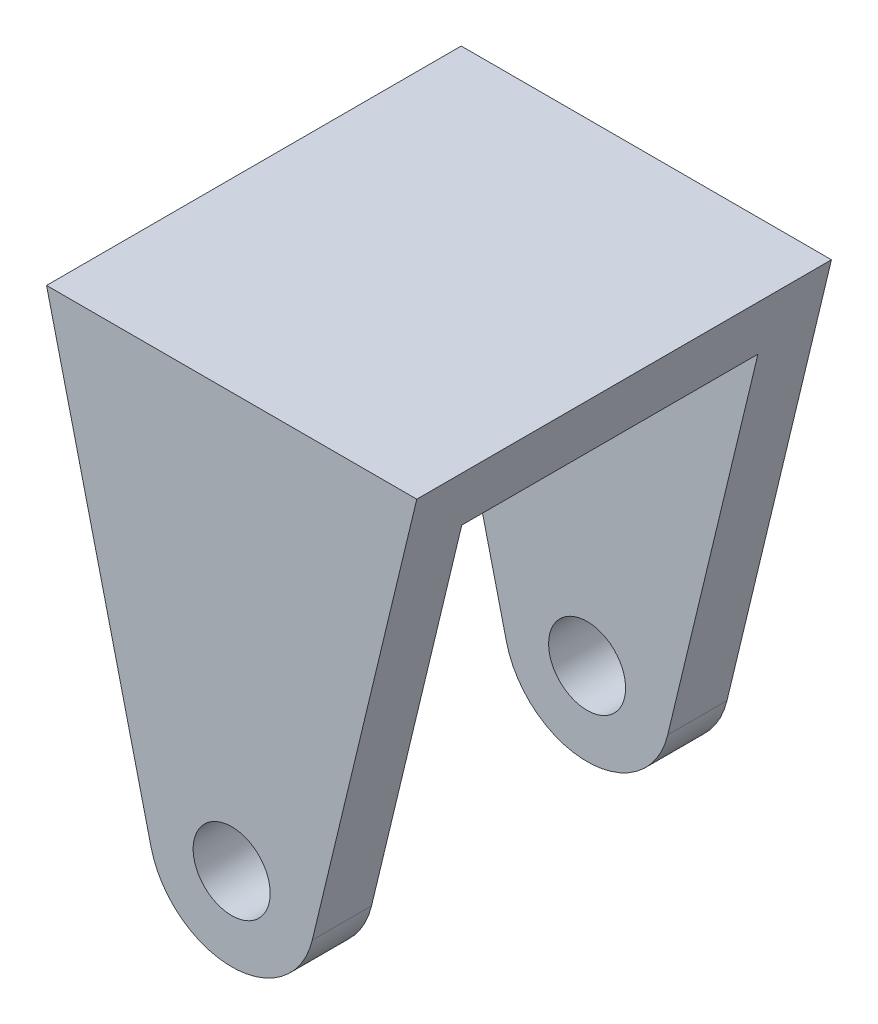
ISO-10303-21;
HEADER;
FILE_DESCRIPTION(('STEP AP214'),'2;1');
FILE_NAME('part.step','',(''),(''),'','','');
FILE_SCHEMA(('AUTOMOTIVE_DESIGN { 1 0 10303 214 1 1 1 1 }'));
ENDSEC;
DATA;
#1=APPLICATION_CONTEXT('core data for automotive mechanical design processes');
#2=APPLICATION_PROTOCOL_DEFINITION('international standard','automotive_design',2000,#1);
#3=PRODUCT_CONTEXT('',#1,'mechanical');
#4=PRODUCT('Part','Part','',(#3));
#5=PRODUCT_RELATED_PRODUCT_CATEGORY('part','',(#4));
#6=PRODUCT_DEFINITION_FORMATION('','',#4);
#7=PRODUCT_DEFINITION_CONTEXT('part definition',#1,'design');
#8=PRODUCT_DEFINITION('design','',#6,#7);
#9=PRODUCT_DEFINITION_SHAPE('','',#8);
#10=(LENGTH_UNIT() NAMED_UNIT(*) SI_UNIT(.MILLI.,.METRE.));
#11=(NAMED_UNIT(*) PLANE_ANGLE_UNIT() SI_UNIT($,.RADIAN.));
#12=(NAMED_UNIT(*) SI_UNIT($,.STERADIAN.) SOLID_ANGLE_UNIT());
#13=UNCERTAINTY_MEASURE_WITH_UNIT(LENGTH_MEASURE(1.E-05),#10,'distance_accuracy_value','');
#14=(GEOMETRIC_REPRESENTATION_CONTEXT(3) GLOBAL_UNCERTAINTY_ASSIGNED_CONTEXT((#13)) GLOBAL_UNIT_ASSIGNED_CONTEXT((#10,
#11,#12)) REPRESENTATION_CONTEXT('',''));
#15=CARTESIAN_POINT('',(0.,0.,0.));
#16=DIRECTION('',(0.,0.,1.));
#17=DIRECTION('',(1.,0.,0.));
#18=AXIS2_PLACEMENT_3D('',#15,#16,#17);
#19=CARTESIAN_POINT('',(0.,0.,140.));
#20=DIRECTION('',(0.,0.,-1.));
#21=DIRECTION('',(-1.,0.,0.));
#22=AXIS2_PLACEMENT_3D('',#19,#20,#21);
#23=CYLINDRICAL_SURFACE('',#22,56.);
#24=DIRECTION('',(0.,0.,-1.));
#25=VECTOR('',#24,1.);
#26=CARTESIAN_POINT('',(54.4448332198552,-13.1057291160068,140.));
#27=LINE('',#26,#25);
#28=CARTESIAN_POINT('',(54.4448332198552,-13.1057291160068,-100.));
#29=VERTEX_POINT('',#28);
#30=CARTESIAN_POINT('',(54.4448332198552,-13.1057291160068,-140.));
#31=VERTEX_POINT('',#30);
#32=EDGE_CURVE('E193',#29,#31,#27,.T.);
#33=ORIENTED_EDGE('',*,*,#32,.F.);
#34=CARTESIAN_POINT('',(0.,0.,-100.));
#35=DIRECTION('',(0.,0.,-1.));
#36=DIRECTION('',(-1.,0.,0.));
#37=AXIS2_PLACEMENT_3D('',#34,#35,#36);
#38=CIRCLE('',#37,56.);
#39=CARTESIAN_POINT('',(-54.4448332198552,-13.1057291160068,-100.));
#40=VERTEX_POINT('',#39);
#41=EDGE_CURVE('E57',#29,#40,#38,.T.);
#42=ORIENTED_EDGE('',*,*,#41,.T.);
#43=DIRECTION('',(0.,0.,-1.));
#44=VECTOR('',#43,1.);
#45=CARTESIAN_POINT('',(-54.4448332198552,-13.1057291160068,140.));
#46=LINE('',#45,#44);
#47=CARTESIAN_POINT('',(-54.4448332198552,-13.1057291160068,-140.));
#48=VERTEX_POINT('',#47);
#49=EDGE_CURVE('E135',#40,#48,#46,.T.);
#50=ORIENTED_EDGE('',*,*,#49,.T.);
#51=CARTESIAN_POINT('',(0.,0.,-140.));
#52=DIRECTION('',(0.,0.,1.));
#53=DIRECTION('',(1.,0.,0.));
#54=AXIS2_PLACEMENT_3D('',#51,#52,#53);
#55=CIRCLE('',#54,56.);
#56=EDGE_CURVE('E173',#48,#31,#55,.T.);
#57=ORIENTED_EDGE('',*,*,#56,.T.);
#58=EDGE_LOOP('',(#33,#42,#50,#57));
#59=FACE_BOUND('',#58,.T.);
#60=ADVANCED_FACE('F41',(#59),#23,.T.);
#61=CARTESIAN_POINT('',(0.,0.,140.));
#62=DIRECTION('',(0.,0.,-1.));
#63=DIRECTION('',(-1.,0.,0.));
#64=AXIS2_PLACEMENT_3D('',#61,#62,#63);
#65=CYLINDRICAL_SURFACE('',#64,26.);
#66=CARTESIAN_POINT('',(0.,0.,100.));
#67=DIRECTION('',(0.,0.,1.));
#68=DIRECTION('',(1.,0.,0.));
#69=AXIS2_PLACEMENT_3D('',#66,#67,#68);
#70=CIRCLE('',#69,26.);
#71=CARTESIAN_POINT('',(26.,0.,100.));
#72=VERTEX_POINT('',#71);
#73=EDGE_CURVE('E137',#72,#72,#70,.T.);
#74=ORIENTED_EDGE('',*,*,#73,.F.);
#75=EDGE_LOOP('',(#74));
#76=FACE_BOUND('',#75,.T.);
#77=CARTESIAN_POINT('',(0.,0.,140.));
#78=DIRECTION('',(0.,0.,1.));
#79=DIRECTION('',(1.,0.,0.));
#80=AXIS2_PLACEMENT_3D('',#77,#78,#79);
#81=CIRCLE('',#80,26.);
#82=CARTESIAN_POINT('',(26.,0.,140.));
#83=VERTEX_POINT('',#82);
#84=EDGE_CURVE('E167',#83,#83,#81,.T.);
#85=ORIENTED_EDGE('',*,*,#84,.T.);
#86=EDGE_LOOP('',(#85));
#87=FACE_BOUND('',#86,.T.);
#88=ADVANCED_FACE('F231',(#76,#87),#65,.F.);
#89=CARTESIAN_POINT('',(-54.4448332198552,-13.1057291160068,140.));
#90=DIRECTION('',(0.972229164640272,0.23403087707155,0.));
#91=DIRECTION('',(-0.23403087707155,0.972229164640272,0.));
#92=AXIS2_PLACEMENT_3D('',#89,#90,#91);
#93=PLANE('',#92);
#94=DIRECTION('',(0.,0.,1.));
#95=VECTOR('',#94,1.);
#96=CARTESIAN_POINT('',(-115.371369813489,240.,140.));
#97=LINE('',#96,#95);
#98=CARTESIAN_POINT('',(-115.371369813489,240.,-100.));
#99=VERTEX_POINT('',#98);
#100=CARTESIAN_POINT('',(-115.371369813489,240.,100.));
#101=VERTEX_POINT('',#100);
#102=EDGE_CURVE('E116',#99,#101,#97,.T.);
#103=ORIENTED_EDGE('',*,*,#102,.T.);
#104=DIRECTION('',(0.23403087707155,-0.972229164640272,0.));
#105=VECTOR('',#104,1.);
#106=CARTESIAN_POINT('',(-54.4448332198552,-13.1057291160068,100.));
#107=LINE('',#106,#105);
#108=CARTESIAN_POINT('',(-54.4448332198552,-13.1057291160068,100.));
#109=VERTEX_POINT('',#108);
#110=EDGE_CURVE('E127',#101,#109,#107,.T.);
#111=ORIENTED_EDGE('',*,*,#110,.T.);
#112=CARTESIAN_POINT('',(-54.4448332198552,-13.1057291160068,140.));
#113=VERTEX_POINT('',#112);
#114=EDGE_CURVE('E50',#113,#109,#46,.T.);
#115=ORIENTED_EDGE('',*,*,#114,.F.);
#116=DIRECTION('',(0.23403087707155,-0.972229164640272,0.));
#117=VECTOR('',#116,1.);
#118=CARTESIAN_POINT('',(-54.4448332198552,-13.1057291160068,140.));
#119=LINE('',#118,#117);
#120=CARTESIAN_POINT('',(-125.,280.,140.));
#121=VERTEX_POINT('',#120);
#122=EDGE_CURVE('E154',#121,#113,#119,.T.);
#123=ORIENTED_EDGE('',*,*,#122,.F.);
#124=DIRECTION('',(0.,0.,-1.));
#125=VECTOR('',#124,1.);
#126=CARTESIAN_POINT('',(-125.,280.,140.));
#127=LINE('',#126,#125);
#128=CARTESIAN_POINT('',(-125.,280.,-140.));
#129=VERTEX_POINT('',#128);
#130=EDGE_CURVE('E66',#121,#129,#127,.T.);
#131=ORIENTED_EDGE('',*,*,#130,.T.);
#132=DIRECTION('',(0.23403087707155,-0.972229164640272,0.));
#133=VECTOR('',#132,1.);
#134=CARTESIAN_POINT('',(-54.4448332198552,-13.1057291160068,-140.));
#135=LINE('',#134,#133);
#136=EDGE_CURVE('E126',#129,#48,#135,.T.);
#137=ORIENTED_EDGE('',*,*,#136,.T.);
#138=ORIENTED_EDGE('',*,*,#49,.F.);
#139=DIRECTION('',(-0.23403087707155,0.972229164640272,0.));
#140=VECTOR('',#139,1.);
#141=CARTESIAN_POINT('',(-54.4448332198552,-13.1057291160068,-100.));
#142=LINE('',#141,#140);
#143=EDGE_CURVE('E130',#40,#99,#142,.T.);
#144=ORIENTED_EDGE('',*,*,#143,.T.);
#145=EDGE_LOOP('',(#103,#111,#115,#123,#131,#137,#138,#144));
#146=FACE_BOUND('',#145,.T.);
#147=ADVANCED_FACE('F43',(#146),#93,.F.);
#148=CARTESIAN_POINT('',(0.,0.,100.));
#149=DIRECTION('',(0.,0.,1.));
#150=DIRECTION('',(1.,0.,0.));
#151=AXIS2_PLACEMENT_3D('',#148,#149,#150);
#152=CIRCLE('',#151,56.);
#153=CARTESIAN_POINT('',(54.4448332198552,-13.1057291160068,100.));
#154=VERTEX_POINT('',#153);
#155=EDGE_CURVE('E149',#109,#154,#152,.T.);
#156=ORIENTED_EDGE('',*,*,#155,.T.);
#157=CARTESIAN_POINT('',(54.4448332198552,-13.1057291160068,140.));
#158=VERTEX_POINT('',#157);
#159=EDGE_CURVE('E194',#158,#154,#27,.T.);
#160=ORIENTED_EDGE('',*,*,#159,.F.);
#161=CARTESIAN_POINT('',(0.,0.,140.));
#162=DIRECTION('',(0.,0.,1.));
#163=DIRECTION('',(1.,0.,0.));
#164=AXIS2_PLACEMENT_3D('',#161,#162,#163);
#165=CIRCLE('',#164,56.);
#166=EDGE_CURVE('E93',#113,#158,#165,.T.);
#167=ORIENTED_EDGE('',*,*,#166,.F.);
#168=ORIENTED_EDGE('',*,*,#114,.T.);
#169=EDGE_LOOP('',(#156,#160,#167,#168));
#170=FACE_BOUND('',#169,.T.);
#171=ADVANCED_FACE('F214',(#170),#23,.T.);
#172=CARTESIAN_POINT('',(54.4448332198552,-13.1057291160068,140.));
#173=DIRECTION('',(0.972229164640272,-0.23403087707155,0.));
#174=DIRECTION('',(0.23403087707155,0.972229164640272,0.));
#175=AXIS2_PLACEMENT_3D('',#172,#173,#174);
#176=PLANE('',#175);
#177=DIRECTION('',(-0.23403087707155,-0.972229164640272,0.));
#178=VECTOR('',#177,1.);
#179=CARTESIAN_POINT('',(54.4448332198552,-13.1057291160068,100.));
#180=LINE('',#179,#178);
#181=CARTESIAN_POINT('',(115.371369813489,240.,100.));
#182=VERTEX_POINT('',#181);
#183=EDGE_CURVE('E142',#182,#154,#180,.T.);
#184=ORIENTED_EDGE('',*,*,#183,.F.);
#185=DIRECTION('',(0.,0.,1.));
#186=VECTOR('',#185,1.);
#187=CARTESIAN_POINT('',(115.371369813489,240.,140.));
#188=LINE('',#187,#186);
#189=CARTESIAN_POINT('',(115.371369813489,240.,-100.));
#190=VERTEX_POINT('',#189);
#191=EDGE_CURVE('E11',#190,#182,#188,.T.);
#192=ORIENTED_EDGE('',*,*,#191,.F.);
#193=DIRECTION('',(0.23403087707155,0.972229164640272,0.));
#194=VECTOR('',#193,1.);
#195=CARTESIAN_POINT('',(54.4448332198552,-13.1057291160068,-100.));
#196=LINE('',#195,#194);
#197=EDGE_CURVE('E131',#29,#190,#196,.T.);
#198=ORIENTED_EDGE('',*,*,#197,.F.);
#199=ORIENTED_EDGE('',*,*,#32,.T.);
#200=DIRECTION('',(-0.23403087707155,-0.972229164640272,0.));
#201=VECTOR('',#200,1.);
#202=CARTESIAN_POINT('',(54.4448332198552,-13.1057291160068,-140.));
#203=LINE('',#202,#201);
#204=CARTESIAN_POINT('',(125.,280.,-140.));
#205=VERTEX_POINT('',#204);
#206=EDGE_CURVE('E177',#205,#31,#203,.T.);
#207=ORIENTED_EDGE('',*,*,#206,.F.);
#208=DIRECTION('',(0.,0.,-1.));
#209=VECTOR('',#208,1.);
#210=CARTESIAN_POINT('',(125.,280.,140.));
#211=LINE('',#210,#209);
#212=CARTESIAN_POINT('',(125.,280.,140.));
#213=VERTEX_POINT('',#212);
#214=EDGE_CURVE('E190',#213,#205,#211,.T.);
#215=ORIENTED_EDGE('',*,*,#214,.F.);
#216=DIRECTION('',(-0.23403087707155,-0.972229164640272,0.));
#217=VECTOR('',#216,1.);
#218=CARTESIAN_POINT('',(54.4448332198552,-13.1057291160068,140.));
#219=LINE('',#218,#217);
#220=EDGE_CURVE('E160',#213,#158,#219,.T.);
#221=ORIENTED_EDGE('',*,*,#220,.T.);
#222=ORIENTED_EDGE('',*,*,#159,.T.);
#223=EDGE_LOOP('',(#184,#192,#198,#199,#207,#215,#221,#222));
#224=FACE_BOUND('',#223,.T.);
#225=ADVANCED_FACE('F212',(#224),#176,.T.);
#226=CARTESIAN_POINT('',(0.,280.,140.));
#227=DIRECTION('',(0.,1.,0.));
#228=DIRECTION('',(0.,0.,1.));
#229=AXIS2_PLACEMENT_3D('',#226,#227,#228);
#230=PLANE('',#229);
#231=DIRECTION('',(1.,0.,0.));
#232=VECTOR('',#231,1.);
#233=CARTESIAN_POINT('',(0.,280.,-140.));
#234=LINE('',#233,#232);
#235=EDGE_CURVE('E181',#129,#205,#234,.T.);
#236=ORIENTED_EDGE('',*,*,#235,.F.);
#237=ORIENTED_EDGE('',*,*,#130,.F.);
#238=DIRECTION('',(1.,0.,0.));
#239=VECTOR('',#238,1.);
#240=CARTESIAN_POINT('',(0.,280.,140.));
#241=LINE('',#240,#239);
#242=EDGE_CURVE('E164',#121,#213,#241,.T.);
#243=ORIENTED_EDGE('',*,*,#242,.T.);
#244=ORIENTED_EDGE('',*,*,#214,.T.);
#245=EDGE_LOOP('',(#236,#237,#243,#244));
#246=FACE_BOUND('',#245,.T.);
#247=ADVANCED_FACE('F220',(#246),#230,.T.);
#248=CARTESIAN_POINT('',(0.,0.,-100.));
#249=DIRECTION('',(0.,0.,-1.));
#250=DIRECTION('',(-1.,0.,0.));
#251=AXIS2_PLACEMENT_3D('',#248,#249,#250);
#252=CIRCLE('',#251,26.);
#253=CARTESIAN_POINT('',(-26.,0.,-100.));
#254=VERTEX_POINT('',#253);
#255=EDGE_CURVE('E200',#254,#254,#252,.T.);
#256=ORIENTED_EDGE('',*,*,#255,.F.);
#257=EDGE_LOOP('',(#256));
#258=FACE_BOUND('',#257,.T.);
#259=CARTESIAN_POINT('',(0.,0.,-140.));
#260=DIRECTION('',(0.,0.,1.));
#261=DIRECTION('',(1.,0.,0.));
#262=AXIS2_PLACEMENT_3D('',#259,#260,#261);
#263=CIRCLE('',#262,26.);
#264=CARTESIAN_POINT('',(26.,0.,-140.));
#265=VERTEX_POINT('',#264);
#266=EDGE_CURVE('E157',#265,#265,#263,.T.);
#267=ORIENTED_EDGE('',*,*,#266,.F.);
#268=EDGE_LOOP('',(#267));
#269=FACE_BOUND('',#268,.T.);
#270=ADVANCED_FACE('F237',(#258,#269),#65,.F.);
#271=CARTESIAN_POINT('',(0.,0.,140.));
#272=DIRECTION('',(0.,0.,1.));
#273=DIRECTION('',(1.,0.,0.));
#274=AXIS2_PLACEMENT_3D('',#271,#272,#273);
#275=PLANE('',#274);
#276=ORIENTED_EDGE('',*,*,#122,.T.);
#277=ORIENTED_EDGE('',*,*,#166,.T.);
#278=ORIENTED_EDGE('',*,*,#220,.F.);
#279=ORIENTED_EDGE('',*,*,#242,.F.);
#280=EDGE_LOOP('',(#276,#277,#278,#279));
#281=FACE_BOUND('',#280,.T.);
#282=ORIENTED_EDGE('',*,*,#84,.F.);
#283=EDGE_LOOP('',(#282));
#284=FACE_BOUND('',#283,.T.);
#285=ADVANCED_FACE('F218',(#281,#284),#275,.T.);
#286=CARTESIAN_POINT('',(0.,0.,-140.));
#287=DIRECTION('',(0.,0.,1.));
#288=DIRECTION('',(1.,0.,0.));
#289=AXIS2_PLACEMENT_3D('',#286,#287,#288);
#290=PLANE('',#289);
#291=ORIENTED_EDGE('',*,*,#136,.F.);
#292=ORIENTED_EDGE('',*,*,#235,.T.);
#293=ORIENTED_EDGE('',*,*,#206,.T.);
#294=ORIENTED_EDGE('',*,*,#56,.F.);
#295=EDGE_LOOP('',(#291,#292,#293,#294));
#296=FACE_BOUND('',#295,.T.);
#297=ORIENTED_EDGE('',*,*,#266,.T.);
#298=EDGE_LOOP('',(#297));
#299=FACE_BOUND('',#298,.T.);
#300=ADVANCED_FACE('F225',(#296,#299),#290,.F.);
#301=CARTESIAN_POINT('',(-125.,240.,100.));
#302=DIRECTION('',(0.,1.,0.));
#303=DIRECTION('',(0.,0.,1.));
#304=AXIS2_PLACEMENT_3D('',#301,#302,#303);
#305=PLANE('',#304);
#306=DIRECTION('',(1.,0.,0.));
#307=VECTOR('',#306,1.);
#308=CARTESIAN_POINT('',(-125.,240.,-100.));
#309=LINE('',#308,#307);
#310=EDGE_CURVE('E119',#99,#190,#309,.T.);
#311=ORIENTED_EDGE('',*,*,#310,.T.);
#312=ORIENTED_EDGE('',*,*,#191,.T.);
#313=DIRECTION('',(1.,0.,0.));
#314=VECTOR('',#313,1.);
#315=CARTESIAN_POINT('',(-125.,240.,100.));
#316=LINE('',#315,#314);
#317=EDGE_CURVE('E122',#101,#182,#316,.T.);
#318=ORIENTED_EDGE('',*,*,#317,.F.);
#319=ORIENTED_EDGE('',*,*,#102,.F.);
#320=EDGE_LOOP('',(#311,#312,#318,#319));
#321=FACE_BOUND('',#320,.T.);
#322=ADVANCED_FACE('F118',(#321),#305,.F.);
#323=CARTESIAN_POINT('',(-125.,-56.,100.));
#324=DIRECTION('',(0.,0.,1.));
#325=DIRECTION('',(1.,0.,0.));
#326=AXIS2_PLACEMENT_3D('',#323,#324,#325);
#327=PLANE('',#326);
#328=ORIENTED_EDGE('',*,*,#73,.T.);
#329=EDGE_LOOP('',(#328));
#330=FACE_BOUND('',#329,.T.);
#331=ORIENTED_EDGE('',*,*,#317,.T.);
#332=ORIENTED_EDGE('',*,*,#183,.T.);
#333=ORIENTED_EDGE('',*,*,#155,.F.);
#334=ORIENTED_EDGE('',*,*,#110,.F.);
#335=EDGE_LOOP('',(#331,#332,#333,#334));
#336=FACE_BOUND('',#335,.T.);
#337=ADVANCED_FACE('F210',(#330,#336),#327,.F.);
#338=CARTESIAN_POINT('',(-125.,-56.,-100.));
#339=DIRECTION('',(0.,0.,-1.));
#340=DIRECTION('',(-1.,0.,0.));
#341=AXIS2_PLACEMENT_3D('',#338,#339,#340);
#342=PLANE('',#341);
#343=ORIENTED_EDGE('',*,*,#255,.T.);
#344=EDGE_LOOP('',(#343));
#345=FACE_BOUND('',#344,.T.);
#346=ORIENTED_EDGE('',*,*,#41,.F.);
#347=ORIENTED_EDGE('',*,*,#197,.T.);
#348=ORIENTED_EDGE('',*,*,#310,.F.);
#349=ORIENTED_EDGE('',*,*,#143,.F.);
#350=EDGE_LOOP('',(#346,#347,#348,#349));
#351=FACE_BOUND('',#350,.T.);
#352=ADVANCED_FACE('F129',(#345,#351),#342,.F.);
#353=CLOSED_SHELL('',(#60,#88,#147,#171,#225,#247,#270,#285,#300,#322,#337,#352));
#354=MANIFOLD_SOLID_BREP('B2',#353);
#355=ADVANCED_BREP_SHAPE_REPRESENTATION('',(#18,#354),#14);
#356=SHAPE_DEFINITION_REPRESENTATION(#9,#355);
ENDSEC;
END-ISO-10303-21;
